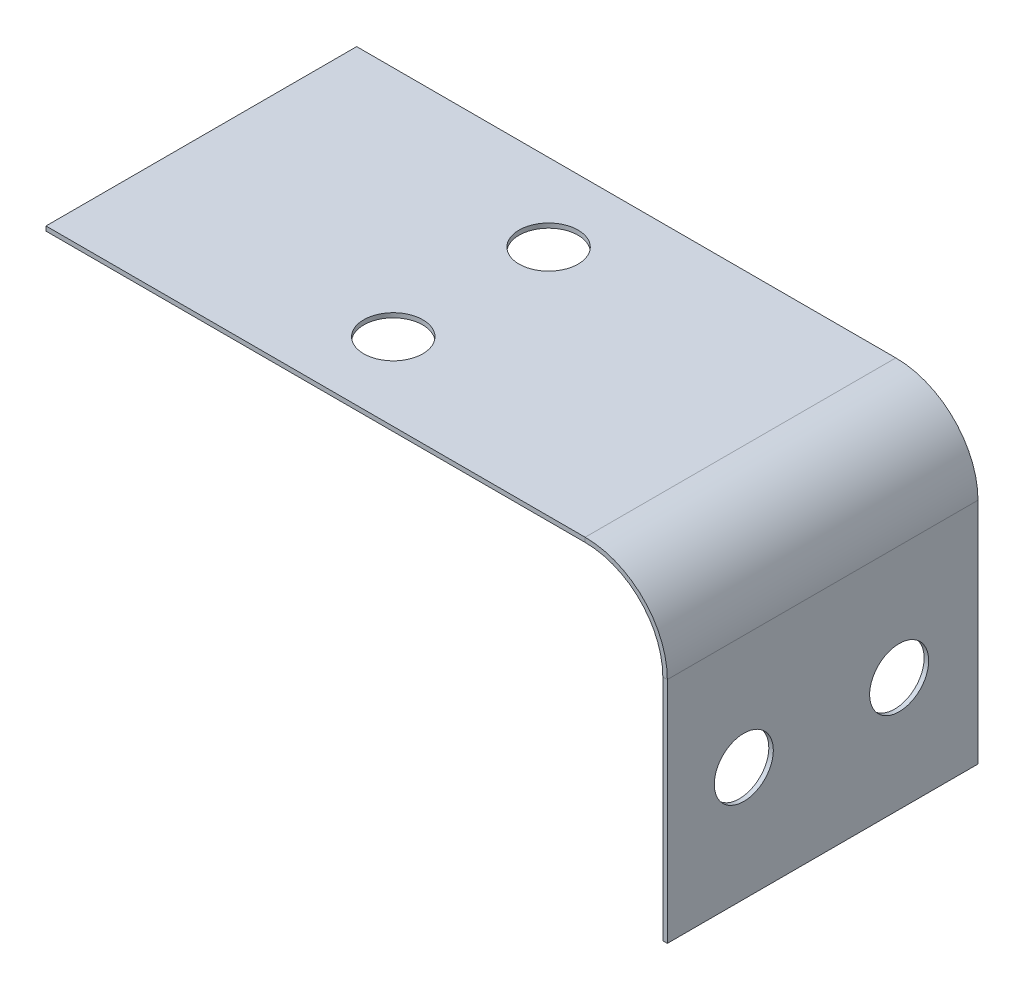
ISO-10303-21;
HEADER;
FILE_DESCRIPTION(('STEP AP214'),'2;1');
FILE_NAME('part.step','',(''),(''),'','','');
FILE_SCHEMA(('AUTOMOTIVE_DESIGN { 1 0 10303 214 1 1 1 1 }'));
ENDSEC;
DATA;
#1=APPLICATION_CONTEXT('core data for automotive mechanical design processes');
#2=APPLICATION_PROTOCOL_DEFINITION('international standard','automotive_design',2000,#1);
#3=PRODUCT_CONTEXT('',#1,'mechanical');
#4=PRODUCT('Part','Part','',(#3));
#5=PRODUCT_RELATED_PRODUCT_CATEGORY('part','',(#4));
#6=PRODUCT_DEFINITION_FORMATION('','',#4);
#7=PRODUCT_DEFINITION_CONTEXT('part definition',#1,'design');
#8=PRODUCT_DEFINITION('design','',#6,#7);
#9=PRODUCT_DEFINITION_SHAPE('','',#8);
#10=(LENGTH_UNIT() NAMED_UNIT(*) SI_UNIT(.MILLI.,.METRE.));
#11=(NAMED_UNIT(*) PLANE_ANGLE_UNIT() SI_UNIT($,.RADIAN.));
#12=(NAMED_UNIT(*) SI_UNIT($,.STERADIAN.) SOLID_ANGLE_UNIT());
#13=UNCERTAINTY_MEASURE_WITH_UNIT(LENGTH_MEASURE(1.E-05),#10,'distance_accuracy_value','');
#14=(GEOMETRIC_REPRESENTATION_CONTEXT(3) GLOBAL_UNCERTAINTY_ASSIGNED_CONTEXT((#13)) GLOBAL_UNIT_ASSIGNED_CONTEXT((#10,
#11,#12)) REPRESENTATION_CONTEXT('',''));
#15=CARTESIAN_POINT('',(0.,0.,0.));
#16=DIRECTION('',(0.,0.,1.));
#17=DIRECTION('',(1.,0.,0.));
#18=AXIS2_PLACEMENT_3D('',#15,#16,#17);
#19=CARTESIAN_POINT('',(29.2404199274448,-13.4366,50.8));
#20=DIRECTION('',(0.,0.,1.));
#21=DIRECTION('',(1.,0.,0.));
#22=AXIS2_PLACEMENT_3D('',#19,#20,#21);
#23=PLANE('',#22);
#24=DIRECTION('',(-1.,0.,0.));
#25=VECTOR('',#24,1.);
#26=CARTESIAN_POINT('',(29.2404199274448,-13.4366,50.8));
#27=LINE('',#26,#25);
#28=CARTESIAN_POINT('',(29.2404199274448,-13.4366,50.8));
#29=VERTEX_POINT('',#28);
#30=CARTESIAN_POINT('',(28.5038199274448,-13.4366,50.8));
#31=VERTEX_POINT('',#30);
#32=EDGE_CURVE('E11',#29,#31,#27,.T.);
#33=ORIENTED_EDGE('',*,*,#32,.F.);
#34=CARTESIAN_POINT('',(15.8038199274448,-13.4366,50.8));
#35=DIRECTION('',(0.,0.,1.));
#36=DIRECTION('',(1.,0.,0.));
#37=AXIS2_PLACEMENT_3D('',#34,#35,#36);
#38=CIRCLE('',#37,13.4366);
#39=CARTESIAN_POINT('',(15.8038199274448,0.,50.8));
#40=VERTEX_POINT('',#39);
#41=EDGE_CURVE('E135',#40,#29,#38,.F.);
#42=ORIENTED_EDGE('',*,*,#41,.F.);
#43=DIRECTION('',(0.,1.,0.));
#44=VECTOR('',#43,1.);
#45=CARTESIAN_POINT('',(15.8038199274448,-0.7366,50.8));
#46=LINE('',#45,#44);
#47=CARTESIAN_POINT('',(15.8038199274448,-0.7366,50.8));
#48=VERTEX_POINT('',#47);
#49=EDGE_CURVE('E45',#48,#40,#46,.T.);
#50=ORIENTED_EDGE('',*,*,#49,.F.);
#51=CARTESIAN_POINT('',(15.8038199274448,-13.4366,50.8));
#52=DIRECTION('',(0.,0.,1.));
#53=DIRECTION('',(1.,0.,0.));
#54=AXIS2_PLACEMENT_3D('',#51,#52,#53);
#55=CIRCLE('',#54,12.7);
#56=EDGE_CURVE('E128',#48,#31,#55,.F.);
#57=ORIENTED_EDGE('',*,*,#56,.T.);
#58=EDGE_LOOP('',(#33,#42,#50,#57));
#59=FACE_BOUND('',#58,.T.);
#60=ADVANCED_FACE('F36',(#59),#23,.T.);
#61=CARTESIAN_POINT('',(15.8038199274448,-0.7366,50.8));
#62=DIRECTION('',(0.,0.,1.));
#63=DIRECTION('',(1.,0.,0.));
#64=AXIS2_PLACEMENT_3D('',#61,#62,#63);
#65=PLANE('',#64);
#66=DIRECTION('',(0.,-1.,0.));
#67=VECTOR('',#66,1.);
#68=CARTESIAN_POINT('',(29.2404199274448,0.,50.8));
#69=LINE('',#68,#67);
#70=CARTESIAN_POINT('',(29.2404199274448,-50.8,50.8));
#71=VERTEX_POINT('',#70);
#72=EDGE_CURVE('E204',#29,#71,#69,.T.);
#73=ORIENTED_EDGE('',*,*,#72,.F.);
#74=ORIENTED_EDGE('',*,*,#32,.T.);
#75=DIRECTION('',(0.,-1.,0.));
#76=VECTOR('',#75,1.);
#77=CARTESIAN_POINT('',(28.5038199274448,0.,50.8));
#78=LINE('',#77,#76);
#79=CARTESIAN_POINT('',(28.5038199274448,-50.8,50.8));
#80=VERTEX_POINT('',#79);
#81=EDGE_CURVE('E94',#31,#80,#78,.T.);
#82=ORIENTED_EDGE('',*,*,#81,.T.);
#83=DIRECTION('',(-1.,0.,0.));
#84=VECTOR('',#83,1.);
#85=CARTESIAN_POINT('',(29.2404199274448,-50.8,50.8));
#86=LINE('',#85,#84);
#87=EDGE_CURVE('E201',#71,#80,#86,.T.);
#88=ORIENTED_EDGE('',*,*,#87,.F.);
#89=EDGE_LOOP('',(#73,#74,#82,#88));
#90=FACE_BOUND('',#89,.T.);
#91=ADVANCED_FACE('F224',(#90),#65,.T.);
#92=CARTESIAN_POINT('',(15.8038199274448,0.,0.));
#93=DIRECTION('',(0.,0.,-1.));
#94=DIRECTION('',(-1.,0.,0.));
#95=AXIS2_PLACEMENT_3D('',#92,#93,#94);
#96=PLANE('',#95);
#97=DIRECTION('',(0.,-1.,0.));
#98=VECTOR('',#97,1.);
#99=CARTESIAN_POINT('',(15.8038199274448,0.,0.));
#100=LINE('',#99,#98);
#101=CARTESIAN_POINT('',(15.8038199274448,0.,0.));
#102=VERTEX_POINT('',#101);
#103=CARTESIAN_POINT('',(15.8038199274448,-0.7366,0.));
#104=VERTEX_POINT('',#103);
#105=EDGE_CURVE('E81',#102,#104,#100,.T.);
#106=ORIENTED_EDGE('',*,*,#105,.F.);
#107=CARTESIAN_POINT('',(15.8038199274448,-13.4366,0.));
#108=DIRECTION('',(0.,0.,1.));
#109=DIRECTION('',(1.,0.,0.));
#110=AXIS2_PLACEMENT_3D('',#107,#108,#109);
#111=CIRCLE('',#110,13.4366);
#112=CARTESIAN_POINT('',(29.2404199274448,-13.4366,0.));
#113=VERTEX_POINT('',#112);
#114=EDGE_CURVE('E151',#102,#113,#111,.F.);
#115=ORIENTED_EDGE('',*,*,#114,.T.);
#116=DIRECTION('',(1.,0.,0.));
#117=VECTOR('',#116,1.);
#118=CARTESIAN_POINT('',(28.5038199274448,-13.4366,0.));
#119=LINE('',#118,#117);
#120=CARTESIAN_POINT('',(28.5038199274448,-13.4366,0.));
#121=VERTEX_POINT('',#120);
#122=EDGE_CURVE('E88',#121,#113,#119,.T.);
#123=ORIENTED_EDGE('',*,*,#122,.F.);
#124=CARTESIAN_POINT('',(15.8038199274448,-13.4366,0.));
#125=DIRECTION('',(0.,0.,1.));
#126=DIRECTION('',(1.,0.,0.));
#127=AXIS2_PLACEMENT_3D('',#124,#125,#126);
#128=CIRCLE('',#127,12.7);
#129=EDGE_CURVE('E158',#104,#121,#128,.F.);
#130=ORIENTED_EDGE('',*,*,#129,.F.);
#131=EDGE_LOOP('',(#106,#115,#123,#130));
#132=FACE_BOUND('',#131,.T.);
#133=ADVANCED_FACE('F222',(#132),#96,.T.);
#134=CARTESIAN_POINT('',(28.5038199274448,-13.4366,0.));
#135=DIRECTION('',(0.,0.,-1.));
#136=DIRECTION('',(-1.,0.,0.));
#137=AXIS2_PLACEMENT_3D('',#134,#135,#136);
#138=PLANE('',#137);
#139=DIRECTION('',(1.,0.,0.));
#140=VECTOR('',#139,1.);
#141=CARTESIAN_POINT('',(-72.3595800725552,0.,0.));
#142=LINE('',#141,#140);
#143=CARTESIAN_POINT('',(-72.3595800725552,0.,0.));
#144=VERTEX_POINT('',#143);
#145=EDGE_CURVE('E153',#144,#102,#142,.T.);
#146=ORIENTED_EDGE('',*,*,#145,.T.);
#147=ORIENTED_EDGE('',*,*,#105,.T.);
#148=DIRECTION('',(1.,0.,0.));
#149=VECTOR('',#148,1.);
#150=CARTESIAN_POINT('',(-72.3595800725552,-0.7366,0.));
#151=LINE('',#150,#149);
#152=CARTESIAN_POINT('',(-72.3595800725552,-0.7366,0.));
#153=VERTEX_POINT('',#152);
#154=EDGE_CURVE('E156',#153,#104,#151,.T.);
#155=ORIENTED_EDGE('',*,*,#154,.F.);
#156=DIRECTION('',(0.,1.,0.));
#157=VECTOR('',#156,1.);
#158=CARTESIAN_POINT('',(-72.3595800725552,-0.7366,0.));
#159=LINE('',#158,#157);
#160=EDGE_CURVE('E116',#153,#144,#159,.T.);
#161=ORIENTED_EDGE('',*,*,#160,.T.);
#162=EDGE_LOOP('',(#146,#147,#155,#161));
#163=FACE_BOUND('',#162,.T.);
#164=ADVANCED_FACE('F218',(#163),#138,.T.);
#165=CARTESIAN_POINT('',(28.5038199274448,0.,50.8));
#166=DIRECTION('',(1.,0.,0.));
#167=DIRECTION('',(0.,1.,0.));
#168=AXIS2_PLACEMENT_3D('',#165,#166,#167);
#169=PLANE('',#168);
#170=CARTESIAN_POINT('',(28.5038199274448,-32.1183,38.2948726435575));
#171=DIRECTION('',(1.,0.,0.));
#172=DIRECTION('',(0.,1.,0.));
#173=AXIS2_PLACEMENT_3D('',#170,#171,#172);
#174=CIRCLE('',#173,4.826);
#175=CARTESIAN_POINT('',(28.5038199274448,-27.2923,38.2948726435575));
#176=VERTEX_POINT('',#175);
#177=EDGE_CURVE('E183',#176,#176,#174,.T.);
#178=ORIENTED_EDGE('',*,*,#177,.T.);
#179=EDGE_LOOP('',(#178));
#180=FACE_BOUND('',#179,.T.);
#181=CARTESIAN_POINT('',(28.5038199274448,-32.1183,12.8948726435575));
#182=DIRECTION('',(1.,0.,0.));
#183=DIRECTION('',(0.,1.,0.));
#184=AXIS2_PLACEMENT_3D('',#181,#182,#183);
#185=CIRCLE('',#184,4.826);
#186=CARTESIAN_POINT('',(28.5038199274448,-27.2923,12.8948726435575));
#187=VERTEX_POINT('',#186);
#188=EDGE_CURVE('E145',#187,#187,#185,.T.);
#189=ORIENTED_EDGE('',*,*,#188,.T.);
#190=EDGE_LOOP('',(#189));
#191=FACE_BOUND('',#190,.T.);
#192=DIRECTION('',(0.,-1.,0.));
#193=VECTOR('',#192,1.);
#194=CARTESIAN_POINT('',(28.5038199274448,0.,0.));
#195=LINE('',#194,#193);
#196=CARTESIAN_POINT('',(28.5038199274448,-50.8,0.));
#197=VERTEX_POINT('',#196);
#198=EDGE_CURVE('E141',#121,#197,#195,.T.);
#199=ORIENTED_EDGE('',*,*,#198,.T.);
#200=DIRECTION('',(0.,0.,-1.));
#201=VECTOR('',#200,1.);
#202=CARTESIAN_POINT('',(28.5038199274448,-50.8,50.8));
#203=LINE('',#202,#201);
#204=EDGE_CURVE('E172',#80,#197,#203,.T.);
#205=ORIENTED_EDGE('',*,*,#204,.F.);
#206=ORIENTED_EDGE('',*,*,#81,.F.);
#207=DIRECTION('',(0.,0.,-1.));
#208=VECTOR('',#207,1.);
#209=CARTESIAN_POINT('',(28.5038199274448,-13.4366,50.8));
#210=LINE('',#209,#208);
#211=EDGE_CURVE('E140',#31,#121,#210,.T.);
#212=ORIENTED_EDGE('',*,*,#211,.T.);
#213=EDGE_LOOP('',(#199,#205,#206,#212));
#214=FACE_BOUND('',#213,.T.);
#215=ADVANCED_FACE('F230',(#180,#191,#214),#169,.F.);
#216=CARTESIAN_POINT('',(29.2404199274448,-50.8,50.8));
#217=DIRECTION('',(0.,-1.,0.));
#218=DIRECTION('',(0.,0.,-1.));
#219=AXIS2_PLACEMENT_3D('',#216,#217,#218);
#220=PLANE('',#219);
#221=DIRECTION('',(-1.,0.,0.));
#222=VECTOR('',#221,1.);
#223=CARTESIAN_POINT('',(29.2404199274448,-50.8,0.));
#224=LINE('',#223,#222);
#225=CARTESIAN_POINT('',(29.2404199274448,-50.8,0.));
#226=VERTEX_POINT('',#225);
#227=EDGE_CURVE('E144',#226,#197,#224,.T.);
#228=ORIENTED_EDGE('',*,*,#227,.F.);
#229=DIRECTION('',(0.,0.,-1.));
#230=VECTOR('',#229,1.);
#231=CARTESIAN_POINT('',(29.2404199274448,-50.8,50.8));
#232=LINE('',#231,#230);
#233=EDGE_CURVE('E170',#71,#226,#232,.T.);
#234=ORIENTED_EDGE('',*,*,#233,.F.);
#235=ORIENTED_EDGE('',*,*,#87,.T.);
#236=ORIENTED_EDGE('',*,*,#204,.T.);
#237=EDGE_LOOP('',(#228,#234,#235,#236));
#238=FACE_BOUND('',#237,.T.);
#239=ADVANCED_FACE('F259',(#238),#220,.T.);
#240=CARTESIAN_POINT('',(29.2404199274448,0.,50.8));
#241=DIRECTION('',(1.,0.,0.));
#242=DIRECTION('',(0.,1.,0.));
#243=AXIS2_PLACEMENT_3D('',#240,#241,#242);
#244=PLANE('',#243);
#245=CARTESIAN_POINT('',(29.2404199274448,-32.1183,38.2948726435575));
#246=DIRECTION('',(1.,0.,0.));
#247=DIRECTION('',(0.,1.,0.));
#248=AXIS2_PLACEMENT_3D('',#245,#246,#247);
#249=CIRCLE('',#248,4.826);
#250=CARTESIAN_POINT('',(29.2404199274448,-27.2923,38.2948726435575));
#251=VERTEX_POINT('',#250);
#252=EDGE_CURVE('E178',#251,#251,#249,.T.);
#253=ORIENTED_EDGE('',*,*,#252,.F.);
#254=EDGE_LOOP('',(#253));
#255=FACE_BOUND('',#254,.T.);
#256=CARTESIAN_POINT('',(29.2404199274448,-32.1183,12.8948726435575));
#257=DIRECTION('',(1.,0.,0.));
#258=DIRECTION('',(0.,1.,0.));
#259=AXIS2_PLACEMENT_3D('',#256,#257,#258);
#260=CIRCLE('',#259,4.826);
#261=CARTESIAN_POINT('',(29.2404199274448,-27.2923,12.8948726435575));
#262=VERTEX_POINT('',#261);
#263=EDGE_CURVE('E195',#262,#262,#260,.T.);
#264=ORIENTED_EDGE('',*,*,#263,.F.);
#265=EDGE_LOOP('',(#264));
#266=FACE_BOUND('',#265,.T.);
#267=DIRECTION('',(0.,-1.,0.));
#268=VECTOR('',#267,1.);
#269=CARTESIAN_POINT('',(29.2404199274448,0.,0.));
#270=LINE('',#269,#268);
#271=EDGE_CURVE('E148',#113,#226,#270,.T.);
#272=ORIENTED_EDGE('',*,*,#271,.F.);
#273=DIRECTION('',(0.,0.,-1.));
#274=VECTOR('',#273,1.);
#275=CARTESIAN_POINT('',(29.2404199274448,-13.4366,50.8));
#276=LINE('',#275,#274);
#277=EDGE_CURVE('E167',#29,#113,#276,.T.);
#278=ORIENTED_EDGE('',*,*,#277,.F.);
#279=ORIENTED_EDGE('',*,*,#72,.T.);
#280=ORIENTED_EDGE('',*,*,#233,.T.);
#281=EDGE_LOOP('',(#272,#278,#279,#280));
#282=FACE_BOUND('',#281,.T.);
#283=ADVANCED_FACE('F264',(#255,#266,#282),#244,.T.);
#284=CARTESIAN_POINT('',(15.8038199274448,-13.4366,50.8));
#285=DIRECTION('',(0.,0.,-1.));
#286=DIRECTION('',(-1.,0.,0.));
#287=AXIS2_PLACEMENT_3D('',#284,#285,#286);
#288=CYLINDRICAL_SURFACE('',#287,13.4366);
#289=ORIENTED_EDGE('',*,*,#114,.F.);
#290=DIRECTION('',(0.,0.,-1.));
#291=VECTOR('',#290,1.);
#292=CARTESIAN_POINT('',(15.8038199274448,0.,50.8));
#293=LINE('',#292,#291);
#294=EDGE_CURVE('E164',#40,#102,#293,.T.);
#295=ORIENTED_EDGE('',*,*,#294,.F.);
#296=ORIENTED_EDGE('',*,*,#41,.T.);
#297=ORIENTED_EDGE('',*,*,#277,.T.);
#298=EDGE_LOOP('',(#289,#295,#296,#297));
#299=FACE_BOUND('',#298,.T.);
#300=ADVANCED_FACE('F211',(#299),#288,.T.);
#301=CARTESIAN_POINT('',(-72.3595800725552,0.,50.8));
#302=DIRECTION('',(0.,1.,0.));
#303=DIRECTION('',(0.,0.,1.));
#304=AXIS2_PLACEMENT_3D('',#301,#302,#303);
#305=PLANE('',#304);
#306=CARTESIAN_POINT('',(-28.2778800725552,0.,12.7));
#307=DIRECTION('',(0.,1.,0.));
#308=DIRECTION('',(0.,0.,1.));
#309=AXIS2_PLACEMENT_3D('',#306,#307,#308);
#310=CIRCLE('',#309,4.826);
#311=CARTESIAN_POINT('',(-28.2778800725552,0.,17.526));
#312=VERTEX_POINT('',#311);
#313=EDGE_CURVE('E190',#312,#312,#310,.T.);
#314=ORIENTED_EDGE('',*,*,#313,.F.);
#315=EDGE_LOOP('',(#314));
#316=FACE_BOUND('',#315,.T.);
#317=CARTESIAN_POINT('',(-28.2778800725552,0.,38.1));
#318=DIRECTION('',(0.,1.,0.));
#319=DIRECTION('',(0.,0.,1.));
#320=AXIS2_PLACEMENT_3D('',#317,#318,#319);
#321=CIRCLE('',#320,4.826);
#322=CARTESIAN_POINT('',(-28.2778800725552,0.,42.926));
#323=VERTEX_POINT('',#322);
#324=EDGE_CURVE('E179',#323,#323,#321,.T.);
#325=ORIENTED_EDGE('',*,*,#324,.F.);
#326=EDGE_LOOP('',(#325));
#327=FACE_BOUND('',#326,.T.);
#328=ORIENTED_EDGE('',*,*,#145,.F.);
#329=DIRECTION('',(0.,0.,-1.));
#330=VECTOR('',#329,1.);
#331=CARTESIAN_POINT('',(-72.3595800725552,0.,50.8));
#332=LINE('',#331,#330);
#333=CARTESIAN_POINT('',(-72.3595800725552,0.,50.8));
#334=VERTEX_POINT('',#333);
#335=EDGE_CURVE('E118',#334,#144,#332,.T.);
#336=ORIENTED_EDGE('',*,*,#335,.F.);
#337=DIRECTION('',(1.,0.,0.));
#338=VECTOR('',#337,1.);
#339=CARTESIAN_POINT('',(-72.3595800725552,0.,50.8));
#340=LINE('',#339,#338);
#341=EDGE_CURVE('E133',#334,#40,#340,.T.);
#342=ORIENTED_EDGE('',*,*,#341,.T.);
#343=ORIENTED_EDGE('',*,*,#294,.T.);
#344=EDGE_LOOP('',(#328,#336,#342,#343));
#345=FACE_BOUND('',#344,.T.);
#346=ADVANCED_FACE('F217',(#316,#327,#345),#305,.T.);
#347=CARTESIAN_POINT('',(-72.3595800725552,-0.7366,50.8));
#348=DIRECTION('',(-1.,0.,0.));
#349=DIRECTION('',(0.,0.,1.));
#350=AXIS2_PLACEMENT_3D('',#347,#348,#349);
#351=PLANE('',#350);
#352=ORIENTED_EDGE('',*,*,#160,.F.);
#353=DIRECTION('',(0.,0.,-1.));
#354=VECTOR('',#353,1.);
#355=CARTESIAN_POINT('',(-72.3595800725552,-0.7366,50.8));
#356=LINE('',#355,#354);
#357=CARTESIAN_POINT('',(-72.3595800725552,-0.7366,50.8));
#358=VERTEX_POINT('',#357);
#359=EDGE_CURVE('E110',#358,#153,#356,.T.);
#360=ORIENTED_EDGE('',*,*,#359,.F.);
#361=DIRECTION('',(0.,1.,0.));
#362=VECTOR('',#361,1.);
#363=CARTESIAN_POINT('',(-72.3595800725552,-0.7366,50.8));
#364=LINE('',#363,#362);
#365=EDGE_CURVE('E114',#358,#334,#364,.T.);
#366=ORIENTED_EDGE('',*,*,#365,.T.);
#367=ORIENTED_EDGE('',*,*,#335,.T.);
#368=EDGE_LOOP('',(#352,#360,#366,#367));
#369=FACE_BOUND('',#368,.T.);
#370=ADVANCED_FACE('F112',(#369),#351,.T.);
#371=CARTESIAN_POINT('',(-72.3595800725552,-0.7366,50.8));
#372=DIRECTION('',(0.,1.,0.));
#373=DIRECTION('',(0.,0.,1.));
#374=AXIS2_PLACEMENT_3D('',#371,#372,#373);
#375=PLANE('',#374);
#376=CARTESIAN_POINT('',(-28.2778800725552,-0.7366,12.7));
#377=DIRECTION('',(0.,1.,0.));
#378=DIRECTION('',(0.,0.,1.));
#379=AXIS2_PLACEMENT_3D('',#376,#377,#378);
#380=CIRCLE('',#379,4.826);
#381=CARTESIAN_POINT('',(-28.2778800725552,-0.7366,17.526));
#382=VERTEX_POINT('',#381);
#383=EDGE_CURVE('E39',#382,#382,#380,.T.);
#384=ORIENTED_EDGE('',*,*,#383,.T.);
#385=EDGE_LOOP('',(#384));
#386=FACE_BOUND('',#385,.T.);
#387=CARTESIAN_POINT('',(-28.2778800725552,-0.7366,38.1));
#388=DIRECTION('',(0.,1.,0.));
#389=DIRECTION('',(0.,0.,1.));
#390=AXIS2_PLACEMENT_3D('',#387,#388,#389);
#391=CIRCLE('',#390,4.826);
#392=CARTESIAN_POINT('',(-28.2778800725552,-0.7366,42.926));
#393=VERTEX_POINT('',#392);
#394=EDGE_CURVE('E176',#393,#393,#391,.T.);
#395=ORIENTED_EDGE('',*,*,#394,.T.);
#396=EDGE_LOOP('',(#395));
#397=FACE_BOUND('',#396,.T.);
#398=ORIENTED_EDGE('',*,*,#154,.T.);
#399=DIRECTION('',(0.,0.,-1.));
#400=VECTOR('',#399,1.);
#401=CARTESIAN_POINT('',(15.8038199274448,-0.7366,50.8));
#402=LINE('',#401,#400);
#403=EDGE_CURVE('E119',#48,#104,#402,.T.);
#404=ORIENTED_EDGE('',*,*,#403,.F.);
#405=DIRECTION('',(1.,0.,0.));
#406=VECTOR('',#405,1.);
#407=CARTESIAN_POINT('',(-72.3595800725552,-0.7366,50.8));
#408=LINE('',#407,#406);
#409=EDGE_CURVE('E123',#358,#48,#408,.T.);
#410=ORIENTED_EDGE('',*,*,#409,.F.);
#411=ORIENTED_EDGE('',*,*,#359,.T.);
#412=EDGE_LOOP('',(#398,#404,#410,#411));
#413=FACE_BOUND('',#412,.T.);
#414=ADVANCED_FACE('F124',(#386,#397,#413),#375,.F.);
#415=CARTESIAN_POINT('',(15.8038199274448,-13.4366,50.8));
#416=DIRECTION('',(0.,0.,-1.));
#417=DIRECTION('',(-1.,0.,0.));
#418=AXIS2_PLACEMENT_3D('',#415,#416,#417);
#419=CYLINDRICAL_SURFACE('',#418,12.7);
#420=ORIENTED_EDGE('',*,*,#129,.T.);
#421=ORIENTED_EDGE('',*,*,#211,.F.);
#422=ORIENTED_EDGE('',*,*,#56,.F.);
#423=ORIENTED_EDGE('',*,*,#403,.T.);
#424=EDGE_LOOP('',(#420,#421,#422,#423));
#425=FACE_BOUND('',#424,.T.);
#426=ADVANCED_FACE('F220',(#425),#419,.F.);
#427=CARTESIAN_POINT('',(15.8038199274448,-13.4366,50.8));
#428=DIRECTION('',(0.,0.,1.));
#429=DIRECTION('',(1.,0.,0.));
#430=AXIS2_PLACEMENT_3D('',#427,#428,#429);
#431=PLANE('',#430);
#432=ORIENTED_EDGE('',*,*,#409,.T.);
#433=ORIENTED_EDGE('',*,*,#49,.T.);
#434=ORIENTED_EDGE('',*,*,#341,.F.);
#435=ORIENTED_EDGE('',*,*,#365,.F.);
#436=EDGE_LOOP('',(#432,#433,#434,#435));
#437=FACE_BOUND('',#436,.T.);
#438=ADVANCED_FACE('F131',(#437),#431,.T.);
#439=CARTESIAN_POINT('',(15.8038199274448,-13.4366,0.));
#440=DIRECTION('',(0.,0.,1.));
#441=DIRECTION('',(1.,0.,0.));
#442=AXIS2_PLACEMENT_3D('',#439,#440,#441);
#443=PLANE('',#442);
#444=ORIENTED_EDGE('',*,*,#198,.F.);
#445=ORIENTED_EDGE('',*,*,#122,.T.);
#446=ORIENTED_EDGE('',*,*,#271,.T.);
#447=ORIENTED_EDGE('',*,*,#227,.T.);
#448=EDGE_LOOP('',(#444,#445,#446,#447));
#449=FACE_BOUND('',#448,.T.);
#450=ADVANCED_FACE('F308',(#449),#443,.F.);
#451=CARTESIAN_POINT('',(26.7004199274448,-32.1183,12.8948726435575));
#452=DIRECTION('',(1.,0.,0.));
#453=DIRECTION('',(0.,1.,0.));
#454=AXIS2_PLACEMENT_3D('',#451,#452,#453);
#455=CYLINDRICAL_SURFACE('',#454,4.826);
#456=ORIENTED_EDGE('',*,*,#263,.T.);
#457=EDGE_LOOP('',(#456));
#458=FACE_BOUND('',#457,.T.);
#459=ORIENTED_EDGE('',*,*,#188,.F.);
#460=EDGE_LOOP('',(#459));
#461=FACE_BOUND('',#460,.T.);
#462=ADVANCED_FACE('F318',(#458,#461),#455,.F.);
#463=CARTESIAN_POINT('',(26.7004199274448,-32.1183,38.2948726435575));
#464=DIRECTION('',(1.,0.,0.));
#465=DIRECTION('',(0.,1.,0.));
#466=AXIS2_PLACEMENT_3D('',#463,#464,#465);
#467=CYLINDRICAL_SURFACE('',#466,4.826);
#468=ORIENTED_EDGE('',*,*,#252,.T.);
#469=EDGE_LOOP('',(#468));
#470=FACE_BOUND('',#469,.T.);
#471=ORIENTED_EDGE('',*,*,#177,.F.);
#472=EDGE_LOOP('',(#471));
#473=FACE_BOUND('',#472,.T.);
#474=ADVANCED_FACE('F345',(#470,#473),#467,.F.);
#475=CARTESIAN_POINT('',(-28.2778800725552,-2.54,38.1));
#476=DIRECTION('',(0.,1.,0.));
#477=DIRECTION('',(0.,0.,1.));
#478=AXIS2_PLACEMENT_3D('',#475,#476,#477);
#479=CYLINDRICAL_SURFACE('',#478,4.826);
#480=ORIENTED_EDGE('',*,*,#324,.T.);
#481=EDGE_LOOP('',(#480));
#482=FACE_BOUND('',#481,.T.);
#483=ORIENTED_EDGE('',*,*,#394,.F.);
#484=EDGE_LOOP('',(#483));
#485=FACE_BOUND('',#484,.T.);
#486=ADVANCED_FACE('F356',(#482,#485),#479,.F.);
#487=CARTESIAN_POINT('',(-28.2778800725552,-2.54,12.7));
#488=DIRECTION('',(0.,1.,0.));
#489=DIRECTION('',(0.,0.,1.));
#490=AXIS2_PLACEMENT_3D('',#487,#488,#489);
#491=CYLINDRICAL_SURFACE('',#490,4.826);
#492=ORIENTED_EDGE('',*,*,#313,.T.);
#493=EDGE_LOOP('',(#492));
#494=FACE_BOUND('',#493,.T.);
#495=ORIENTED_EDGE('',*,*,#383,.F.);
#496=EDGE_LOOP('',(#495));
#497=FACE_BOUND('',#496,.T.);
#498=ADVANCED_FACE('F383',(#494,#497),#491,.F.);
#499=CLOSED_SHELL('',(#60,#91,#133,#164,#215,#239,#283,#300,#346,#370,#414,#426,#438,#450,#462,
#474,#486,#498));
#500=MANIFOLD_SOLID_BREP('B2',#499);
#501=ADVANCED_BREP_SHAPE_REPRESENTATION('',(#18,#500),#14);
#502=SHAPE_DEFINITION_REPRESENTATION(#9,#501);
ENDSEC;
END-ISO-10303-21;
